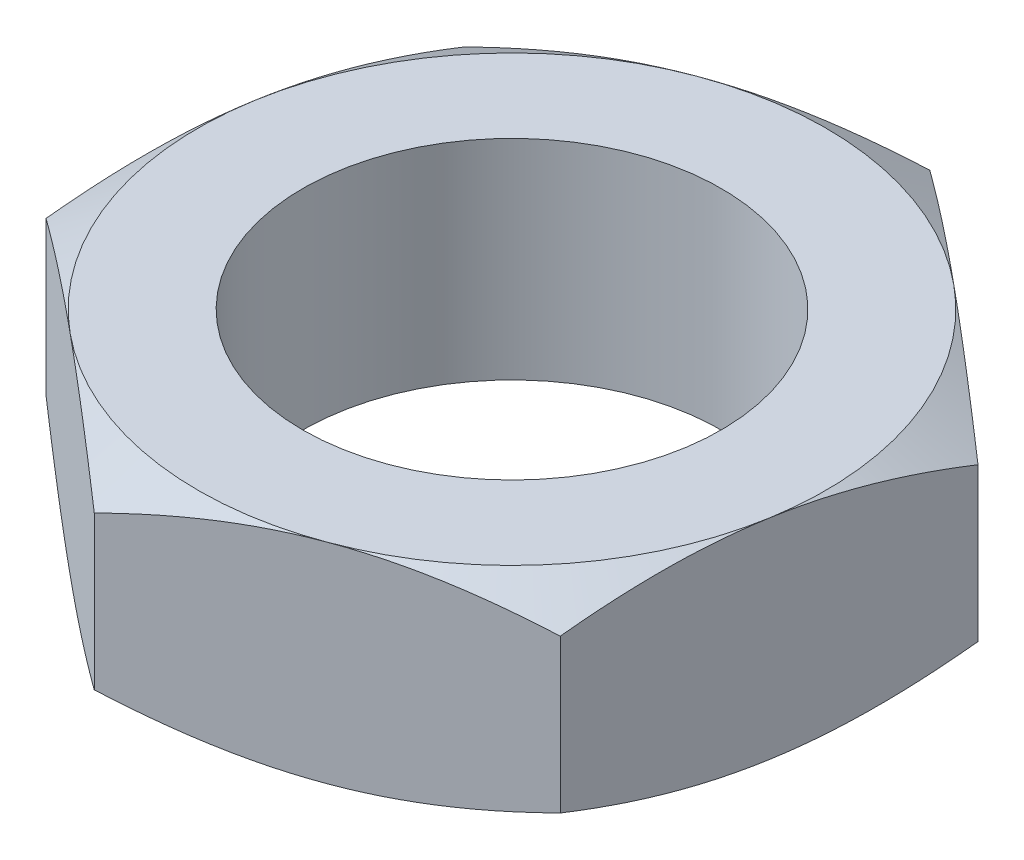
ISO-10303-21;
HEADER;
FILE_DESCRIPTION(('STEP AP214'),'2;1');
FILE_NAME('part.step','',(''),(''),'','','');
FILE_SCHEMA(('AUTOMOTIVE_DESIGN { 1 0 10303 214 1 1 1 1 }'));
ENDSEC;
DATA;
#1=APPLICATION_CONTEXT('core data for automotive mechanical design processes');
#2=APPLICATION_PROTOCOL_DEFINITION('international standard','automotive_design',2000,#1);
#3=PRODUCT_CONTEXT('',#1,'mechanical');
#4=PRODUCT('Part','Part','',(#3));
#5=PRODUCT_RELATED_PRODUCT_CATEGORY('part','',(#4));
#6=PRODUCT_DEFINITION_FORMATION('','',#4);
#7=PRODUCT_DEFINITION_CONTEXT('part definition',#1,'design');
#8=PRODUCT_DEFINITION('design','',#6,#7);
#9=PRODUCT_DEFINITION_SHAPE('','',#8);
#10=(LENGTH_UNIT() NAMED_UNIT(*) SI_UNIT(.MILLI.,.METRE.));
#11=(NAMED_UNIT(*) PLANE_ANGLE_UNIT() SI_UNIT($,.RADIAN.));
#12=(NAMED_UNIT(*) SI_UNIT($,.STERADIAN.) SOLID_ANGLE_UNIT());
#13=UNCERTAINTY_MEASURE_WITH_UNIT(LENGTH_MEASURE(1.E-05),#10,'distance_accuracy_value','');
#14=(GEOMETRIC_REPRESENTATION_CONTEXT(3) GLOBAL_UNCERTAINTY_ASSIGNED_CONTEXT((#13)) GLOBAL_UNIT_ASSIGNED_CONTEXT((#10,
#11,#12)) REPRESENTATION_CONTEXT('',''));
#15=CARTESIAN_POINT('',(0.,0.,0.));
#16=DIRECTION('',(0.,0.,1.));
#17=DIRECTION('',(1.,0.,0.));
#18=AXIS2_PLACEMENT_3D('',#15,#16,#17);
#19=CARTESIAN_POINT('',(-1.44369467023749,5.,8.53907171179209));
#20=DIRECTION('',(-0.34863406811952,0.,-0.937258921828133));
#21=DIRECTION('',(-0.937258921828133,0.,0.34863406811952));
#22=AXIS2_PLACEMENT_3D('',#19,#20,#21);
#23=PLANE('',#22);
#24=CARTESIAN_POINT('',(6.67340569203028,0.669934582085275,5.51973772123151));
#25=CARTESIAN_POINT('',(6.49498732644152,0.61499041368803,5.58610435607892));
#26=CARTESIAN_POINT('',(6.31590373120375,0.562539844764627,5.65271843772397));
#27=CARTESIAN_POINT('',(5.95628219341445,0.463312688605474,5.78648757748136));
#28=CARTESIAN_POINT('',(5.77574365902302,0.416538549046466,5.85364285574156));
#29=CARTESIAN_POINT('',(5.23123744179099,0.285648891076474,6.05618391799114));
#30=CARTESIAN_POINT('',(4.86512041892743,0.211200490063354,6.19236919627024));
#31=CARTESIAN_POINT('',(4.31723296252882,0.123901221271782,6.39616798478786));
#32=CARTESIAN_POINT('',(4.13709953241467,0.0990322370979437,6.46317257560309));
#33=CARTESIAN_POINT('',(3.77601876178583,0.0573306993877993,6.59748450910651));
#34=CARTESIAN_POINT('',(3.59507149461047,0.0404974357964017,6.66479182451452));
#35=CARTESIAN_POINT('',(3.23286270958824,0.0152963397422831,6.79952334777878));
#36=CARTESIAN_POINT('',(3.05160178328159,0.00691890019796405,6.86694733559865));
#37=CARTESIAN_POINT('',(2.68892251831363,-0.00119990207370901,7.0018538642255));
#38=CARTESIAN_POINT('',(2.50750418468866,-0.000941531608342203,7.0693364031591));
#39=CARTESIAN_POINT('',(2.01048216082673,0.0116366203444909,7.25421467541497));
#40=CARTESIAN_POINT('',(1.69504118336627,0.032750367326311,7.37154988414164));
#41=CARTESIAN_POINT('',(1.06625435166348,0.0997010500425559,7.60544097443817));
#42=CARTESIAN_POINT('',(0.752910708611471,0.145560867086196,7.72199603350715));
#43=CARTESIAN_POINT('',(0.122858541479935,0.260196634976687,7.95635779314358));
#44=CARTESIAN_POINT('',(-0.19377048564775,0.32945826489346,8.0741349230715));
#45=CARTESIAN_POINT('',(-0.822306823607496,0.486654039468555,8.30793283671146));
#46=CARTESIAN_POINT('',(-1.13422218333332,0.574551261711175,8.42395661438654));
#47=CARTESIAN_POINT('',(-1.44389467023749,0.669934582085275,8.53914610619048));
#48=B_SPLINE_CURVE_WITH_KNOTS('',3,(#24,#25,#26,#27,#28,#29,#30,#31,#32,#33,#34,#35,#36,#37,#38,
#39,#40,#41,#42,#43,#44,#45,#46,#47),.UNSPECIFIED.,.F.,.F.,(4,2,2,2,2,2,2,2,2,2,2,4),(0.,
0.594350167566524,1.18895571516085,2.38063749631713,2.96188394546358,3.54307902480116,
4.12361303374696,4.70412910684701,5.71472439101079,6.7262557214494,7.76022088252539,
8.79215629474527),.UNSPECIFIED.);
#49=CARTESIAN_POINT('',(6.67320569203028,0.669872981077802,5.5198121156299));
#50=VERTEX_POINT('',#49);
#51=CARTESIAN_POINT('',(2.6147555108964,0.,7.029441913711));
#52=VERTEX_POINT('',#51);
#53=EDGE_CURVE('E125',#50,#52,#48,.T.);
#54=ORIENTED_EDGE('',*,*,#53,.F.);
#55=DIRECTION('',(0.,-1.,0.));
#56=VECTOR('',#55,1.);
#57=CARTESIAN_POINT('',(6.67320569203028,5.,5.5198121156299));
#58=LINE('',#57,#56);
#59=CARTESIAN_POINT('',(6.67320569203028,4.3301270189222,5.5198121156299));
#60=VERTEX_POINT('',#59);
#61=EDGE_CURVE('E247',#60,#50,#58,.T.);
#62=ORIENTED_EDGE('',*,*,#61,.F.);
#63=CARTESIAN_POINT('',(-1.44389467023749,4.33006541791473,8.53914610619048));
#64=CARTESIAN_POINT('',(-1.26547630464873,4.38500958631197,8.47277947134307));
#65=CARTESIAN_POINT('',(-1.08639270941096,4.43746015523537,8.40616538969802));
#66=CARTESIAN_POINT('',(-0.726771171621659,4.53668731139453,8.27239624994063));
#67=CARTESIAN_POINT('',(-0.54623263723023,4.58346145095353,8.20524097168044));
#68=CARTESIAN_POINT('',(-0.00172641999819813,4.71435110892353,8.00269990943085));
#69=CARTESIAN_POINT('',(0.364390602865364,4.78879950993665,7.86651463115175));
#70=CARTESIAN_POINT('',(0.912278059263968,4.87609877872822,7.66271584263413));
#71=CARTESIAN_POINT('',(1.09241148937812,4.90096776290206,7.5957112518189));
#72=CARTESIAN_POINT('',(1.45349226000696,4.9426693006122,7.46139931831548));
#73=CARTESIAN_POINT('',(1.63443952718232,4.9595025642036,7.39409200290748));
#74=CARTESIAN_POINT('',(1.99664831220455,4.98470366025772,7.25936047964321));
#75=CARTESIAN_POINT('',(2.1779092385112,4.99308109980204,7.19193649182334));
#76=CARTESIAN_POINT('',(2.54058850347916,5.00119990207371,7.0570299631965));
#77=CARTESIAN_POINT('',(2.72200683710413,5.00094153160834,6.98954742426289));
#78=CARTESIAN_POINT('',(3.21902886096606,4.98836337965551,6.80466915200702));
#79=CARTESIAN_POINT('',(3.53446983842652,4.96724963267369,6.68733394328035));
#80=CARTESIAN_POINT('',(4.16325667012932,4.90029894995745,6.45344285298383));
#81=CARTESIAN_POINT('',(4.47660031318132,4.85443913291381,6.33688779391484));
#82=CARTESIAN_POINT('',(5.10665248031286,4.73980336502331,6.10252603427841));
#83=CARTESIAN_POINT('',(5.42328150744054,4.67054173510654,5.98474890435049));
#84=CARTESIAN_POINT('',(6.05181784540029,4.51334596053145,5.75095099071054));
#85=CARTESIAN_POINT('',(6.36373320512611,4.42544873828883,5.63492721303545));
#86=CARTESIAN_POINT('',(6.67340569203028,4.33006541791473,5.51973772123151));
#87=B_SPLINE_CURVE_WITH_KNOTS('',3,(#63,#64,#65,#66,#67,#68,#69,#70,#71,#72,#73,#74,#75,#76,#77,
#78,#79,#80,#81,#82,#83,#84,#85,#86),.UNSPECIFIED.,.F.,.F.,(4,2,2,2,2,2,2,2,2,2,2,4),(0.,
0.594350167566525,1.18895571516085,2.38063749631713,2.96188394546359,3.54307902480116,
4.12361303374696,4.70412910684701,5.71472439101079,6.72625572144941,7.76022088252539,
8.79215629474527),.UNSPECIFIED.);
#88=CARTESIAN_POINT('',(2.6147555108964,5.,7.029441913711));
#89=VERTEX_POINT('',#88);
#90=EDGE_CURVE('E228',#89,#60,#87,.T.);
#91=ORIENTED_EDGE('',*,*,#90,.F.);
#92=CARTESIAN_POINT('',(-1.44369467023749,4.3301270189222,8.53907171179209));
#93=VERTEX_POINT('',#92);
#94=EDGE_CURVE('E233',#93,#89,#87,.T.);
#95=ORIENTED_EDGE('',*,*,#94,.F.);
#96=DIRECTION('',(0.,-1.,0.));
#97=VECTOR('',#96,1.);
#98=CARTESIAN_POINT('',(-1.44369467023749,5.,8.53907171179209));
#99=LINE('',#98,#97);
#100=CARTESIAN_POINT('',(-1.44369467023749,0.669872981077804,8.53907171179209));
#101=VERTEX_POINT('',#100);
#102=EDGE_CURVE('E155',#93,#101,#99,.T.);
#103=ORIENTED_EDGE('',*,*,#102,.T.);
#104=EDGE_CURVE('E137',#52,#101,#48,.T.);
#105=ORIENTED_EDGE('',*,*,#104,.F.);
#106=EDGE_LOOP('',(#54,#62,#91,#95,#103,#105));
#107=FACE_BOUND('',#106,.T.);
#108=ADVANCED_FACE('F35',(#107),#23,.F.);
#109=CARTESIAN_POINT('',(6.67320569203028,5.,5.5198121156299));
#110=DIRECTION('',(-0.986007070286536,0.,-0.166703501297848));
#111=DIRECTION('',(-0.166703501297848,0.,0.986007070286536));
#112=AXIS2_PLACEMENT_3D('',#109,#110,#111);
#113=PLANE('',#112);
#114=CARTESIAN_POINT('',(8.11693417612292,0.669931536480535,-3.01945959616219));
#115=CARTESIAN_POINT('',(8.08520019987834,0.614987494088027,-2.83176152922384));
#116=CARTESIAN_POINT('',(8.05334790409476,0.562537054216301,-2.64336363354107));
#117=CARTESIAN_POINT('',(7.98938463854219,0.463310161762978,-2.26503785404365));
#118=CARTESIAN_POINT('',(7.95727356350703,0.416536156859956,-2.07510934760759));
#119=CARTESIAN_POINT('',(7.86042620741353,0.285646912260097,-1.50228287963715));
#120=CARTESIAN_POINT('',(7.79530763940616,0.211198797092288,-1.1171237920216));
#121=CARTESIAN_POINT('',(7.69785888875528,0.123899954229493,-0.54074023448197));
#122=CARTESIAN_POINT('',(7.66581986681431,0.0990311093659153,-0.351237903019766));
#123=CARTESIAN_POINT('',(7.60159705945798,0.0573298489513181,0.0286229975251619));
#124=CARTESIAN_POINT('',(7.56941328708685,0.0404967233463565,0.218981489454665));
#125=CARTESIAN_POINT('',(7.50498984963335,0.0152958983657101,0.600029063901352));
#126=CARTESIAN_POINT('',(7.47275028976229,0.00691859196391466,0.790717524121497));
#127=CARTESIAN_POINT('',(7.40824317319374,-0.00119995198440777,1.17226003837705));
#128=CARTESIAN_POINT('',(7.37597561739202,-0.000941456342233854,1.36311408711427));
#129=CARTESIAN_POINT('',(7.2875741645718,0.0116369901313172,1.88598527353643));
#130=CARTESIAN_POINT('',(7.23146920871259,0.0327507878641885,2.21783123192727));
#131=CARTESIAN_POINT('',(7.11963193933104,0.0997013333310604,2.87931906795497));
#132=CARTESIAN_POINT('',(7.06390001908873,0.145560961828871,3.20895861944455));
#133=CARTESIAN_POINT('',(6.95183769884847,0.260196141216312,3.87177757171231));
#134=CARTESIAN_POINT('',(6.89552143817182,0.329457363606809,4.20487334214886));
#135=CARTESIAN_POINT('',(6.78372872548718,0.486652168279931,4.86609763711207));
#136=CARTESIAN_POINT('',(6.72825084191222,0.574548828915974,5.19423462897829));
#137=CARTESIAN_POINT('',(6.67317187817512,0.669931536480537,5.5200121156299));
#138=B_SPLINE_CURVE_WITH_KNOTS('',3,(#114,#115,#116,#117,#118,#119,#120,#121,#122,#123,#124,
#125,#126,#127,#128,#129,#130,#131,#132,#133,#134,#135,#136,#137),.UNSPECIFIED.,.F.,.F.,(4,2,2,
2,2,2,2,2,2,2,2,4),(0.,0.594349806644115,1.18895499310351,2.380636032122,2.96188215456027,
3.54307690729336,4.12361059346092,4.70412634350593,5.71471695893529,6.72624360304106,
7.76020382983172,8.79213434275382),.UNSPECIFIED.);
#139=CARTESIAN_POINT('',(8.11690036226776,0.669872981077801,-3.01925959616219));
#140=VERTEX_POINT('',#139);
#141=CARTESIAN_POINT('',(7.39505302714902,0.,1.25027625973386));
#142=VERTEX_POINT('',#141);
#143=EDGE_CURVE('E52',#140,#142,#138,.T.);
#144=ORIENTED_EDGE('',*,*,#143,.F.);
#145=DIRECTION('',(0.,-1.,0.));
#146=VECTOR('',#145,1.);
#147=CARTESIAN_POINT('',(8.11690036226776,5.,-3.01925959616219));
#148=LINE('',#147,#146);
#149=CARTESIAN_POINT('',(8.11690036226776,4.3301270189222,-3.01925959616219));
#150=VERTEX_POINT('',#149);
#151=EDGE_CURVE('E244',#150,#140,#148,.T.);
#152=ORIENTED_EDGE('',*,*,#151,.F.);
#153=CARTESIAN_POINT('',(6.67317187817512,4.33006846351947,5.5200121156299));
#154=CARTESIAN_POINT('',(6.7049058544197,4.38501250591197,5.33231404869155));
#155=CARTESIAN_POINT('',(6.73675815020328,4.4374629457837,5.14391615300878));
#156=CARTESIAN_POINT('',(6.80072141575585,4.53668983823702,4.76559037351137));
#157=CARTESIAN_POINT('',(6.83283249079101,4.58346384314005,4.57566186707531));
#158=CARTESIAN_POINT('',(6.92967984688451,4.71435308773991,4.00283539910487));
#159=CARTESIAN_POINT('',(6.99479841489188,4.78880120290771,3.61767631148931));
#160=CARTESIAN_POINT('',(7.09224716554276,4.87610004577051,3.04129275394969));
#161=CARTESIAN_POINT('',(7.12428618748373,4.90096889063409,2.85179042248748));
#162=CARTESIAN_POINT('',(7.18850899484006,4.94267015104868,2.47192952194255));
#163=CARTESIAN_POINT('',(7.22069276721119,4.95950327665364,2.28157103001305));
#164=CARTESIAN_POINT('',(7.28511620466469,4.98470410163429,1.90052345556636));
#165=CARTESIAN_POINT('',(7.31735576453575,4.99308140803609,1.70983499534622));
#166=CARTESIAN_POINT('',(7.3818628811043,5.00119995198441,1.32829248109066));
#167=CARTESIAN_POINT('',(7.41413043690602,5.00094145634224,1.13743843235345));
#168=CARTESIAN_POINT('',(7.50253188972624,4.98836300986868,0.61456724593129));
#169=CARTESIAN_POINT('',(7.55863684558545,4.96724921213581,0.282721287540443));
#170=CARTESIAN_POINT('',(7.670474114967,4.90029866666894,-0.378766548487257));
#171=CARTESIAN_POINT('',(7.72620603520931,4.85443903817113,-0.708406099976839));
#172=CARTESIAN_POINT('',(7.83826835544957,4.73980385878369,-1.3712250522446));
#173=CARTESIAN_POINT('',(7.89458461612622,4.67054263639319,-1.70432082268115));
#174=CARTESIAN_POINT('',(8.00637732881086,4.51334783172007,-2.36554511764435));
#175=CARTESIAN_POINT('',(8.06185521238582,4.42545117108403,-2.69368210951058));
#176=CARTESIAN_POINT('',(8.11693417612292,4.33006846351947,-3.01945959616219));
#177=B_SPLINE_CURVE_WITH_KNOTS('',3,(#153,#154,#155,#156,#157,#158,#159,#160,#161,#162,#163,
#164,#165,#166,#167,#168,#169,#170,#171,#172,#173,#174,#175,#176),.UNSPECIFIED.,.F.,.F.,(4,2,2,
2,2,2,2,2,2,2,2,4),(0.,0.594349806644116,1.18895499310351,2.380636032122,2.96188215456027,
3.54307690729336,4.12361059346092,4.70412634350593,5.71471695893529,6.72624360304106,
7.76020382983172,8.79213434275382),.UNSPECIFIED.);
#178=CARTESIAN_POINT('',(7.39505302714903,5.,1.25027625973386));
#179=VERTEX_POINT('',#178);
#180=EDGE_CURVE('E215',#179,#150,#177,.T.);
#181=ORIENTED_EDGE('',*,*,#180,.F.);
#182=EDGE_CURVE('E221',#60,#179,#177,.T.);
#183=ORIENTED_EDGE('',*,*,#182,.F.);
#184=ORIENTED_EDGE('',*,*,#61,.T.);
#185=EDGE_CURVE('E131',#142,#50,#138,.T.);
#186=ORIENTED_EDGE('',*,*,#185,.F.);
#187=EDGE_LOOP('',(#144,#152,#181,#183,#184,#186));
#188=FACE_BOUND('',#187,.T.);
#189=ADVANCED_FACE('F207',(#188),#113,.F.);
#190=CARTESIAN_POINT('',(8.11690036226776,5.,-3.01925959616219));
#191=DIRECTION('',(-0.637373002167017,0.,0.770555420530285));
#192=DIRECTION('',(0.770555420530285,0.,0.637373002167017));
#193=AXIS2_PLACEMENT_3D('',#190,#191,#192);
#194=PLANE('',#193);
#195=CARTESIAN_POINT('',(1.44349467023748,0.669947909270021,-8.53923714389085));
#196=CARTESIAN_POINT('',(1.59017934429502,0.615003189494995,-8.41790537646054));
#197=CARTESIAN_POINT('',(1.73741092985964,0.562552055860879,-8.29612122543796));
#198=CARTESIAN_POINT('',(2.03306978023781,0.463323745764641,-8.05156390475479));
#199=CARTESIAN_POINT('',(2.18149753162803,0.416549016971252,-7.9287903326172));
#200=CARTESIAN_POINT('',(2.62915730228068,0.285657550155301,-7.55850385565761));
#201=CARTESIAN_POINT('',(2.93015638802546,0.211207898325488,-7.30952930325144));
#202=CARTESIAN_POINT('',(3.38059604417728,0.123906765731987,-6.93694341482957));
#203=CARTESIAN_POINT('',(3.52869074651669,0.099037171956829,-6.81444532770932));
#204=CARTESIAN_POINT('',(3.82554931567242,0.0573344208415764,-6.56889564704964));
#205=CARTESIAN_POINT('',(3.97431312219173,0.040500553441359,-6.44584410338552));
#206=CARTESIAN_POINT('',(4.27209910847214,0.0152982712082999,-6.19952729991901));
#207=CARTESIAN_POINT('',(4.4211208018718,0.00692024905105455,-6.07626244241559));
#208=CARTESIAN_POINT('',(4.71929362297594,-0.001199683607605,-5.82962566446526));
#209=CARTESIAN_POINT('',(4.86844474653956,-0.000941860898707258,-5.7062537474435));
#210=CARTESIAN_POINT('',(5.27707067658355,0.0116350022508556,-5.36825452135774));
#211=CARTESIAN_POINT('',(5.53641172314486,0.0327485271370408,-5.15373785321444));
#212=CARTESIAN_POINT('',(6.05337129392387,0.0996998104171768,-4.72612931936019));
#213=CARTESIAN_POINT('',(6.31098800006821,0.14556045250706,-4.51303895748772));
#214=CARTESIAN_POINT('',(6.82898795637013,0.260198795605913,-4.08456985783058));
#215=CARTESIAN_POINT('',(7.0893058444828,0.329462208806821,-3.86924518494726));
#216=CARTESIAN_POINT('',(7.60605953930169,0.486662227553499,-3.44180694355387));
#217=CARTESIAN_POINT('',(7.86250196394722,0.574561907317877,-3.22968790094584));
#218=CARTESIAN_POINT('',(8.11710036226776,0.669947909270021,-3.01909416406342));
#219=B_SPLINE_CURVE_WITH_KNOTS('',3,(#195,#196,#197,#198,#199,#200,#201,#202,#203,#204,#205,
#206,#207,#208,#209,#210,#211,#212,#213,#214,#215,#216,#217,#218),.UNSPECIFIED.,.F.,.F.,(4,2,2,
2,2,2,2,2,2,2,2,4),(0.,0.594351746917322,1.18895887479238,2.38064390344968,2.96189178223027,
3.54308829074832,4.12362371213127,4.70414119887973,5.71475691272487,6.72630874985524,
7.76029550264454,8.792252353473),.UNSPECIFIED.);
#220=CARTESIAN_POINT('',(1.44369467023748,0.669872981077803,-8.53907171179209));
#221=VERTEX_POINT('',#220);
#222=CARTESIAN_POINT('',(4.78029751625262,0.,-5.77916565397714));
#223=VERTEX_POINT('',#222);
#224=EDGE_CURVE('E59',#221,#223,#219,.T.);
#225=ORIENTED_EDGE('',*,*,#224,.F.);
#226=DIRECTION('',(0.,-1.,0.));
#227=VECTOR('',#226,1.);
#228=CARTESIAN_POINT('',(1.44369467023748,5.,-8.53907171179209));
#229=LINE('',#228,#227);
#230=CARTESIAN_POINT('',(1.44369467023748,4.3301270189222,-8.53907171179209));
#231=VERTEX_POINT('',#230);
#232=EDGE_CURVE('E241',#231,#221,#229,.T.);
#233=ORIENTED_EDGE('',*,*,#232,.F.);
#234=CARTESIAN_POINT('',(8.11710036226776,4.33005209072998,-3.01909416406342));
#235=CARTESIAN_POINT('',(7.97041568821022,4.38499681050501,-3.14042593149373));
#236=CARTESIAN_POINT('',(7.82318410264561,4.43744794413912,-3.26221008251631));
#237=CARTESIAN_POINT('',(7.52752525226744,4.53667625423536,-3.50676740319948));
#238=CARTESIAN_POINT('',(7.37909750087722,4.58345098302875,-3.62954097533707));
#239=CARTESIAN_POINT('',(6.93143773022457,4.7143424498447,-3.99982745229667));
#240=CARTESIAN_POINT('',(6.63043864447979,4.78879210167451,-4.24880200470283));
#241=CARTESIAN_POINT('',(6.17999898832797,4.87609323426802,-4.62138789312471));
#242=CARTESIAN_POINT('',(6.03190428598856,4.90096282804317,-4.74388598024496));
#243=CARTESIAN_POINT('',(5.73504571683282,4.94266557915843,-4.98943566090464));
#244=CARTESIAN_POINT('',(5.58628191031351,4.95949944655864,-5.11248720456875));
#245=CARTESIAN_POINT('',(5.28849592403311,4.9847017287917,-5.35880400803526));
#246=CARTESIAN_POINT('',(5.13947423063345,4.99307975094895,-5.48206886553868));
#247=CARTESIAN_POINT('',(4.8413014095293,5.00119968360761,-5.72870564348902));
#248=CARTESIAN_POINT('',(4.69215028596569,5.00094186089871,-5.85207756051077));
#249=CARTESIAN_POINT('',(4.2835243559217,4.98836499774915,-6.19007678659654));
#250=CARTESIAN_POINT('',(4.02418330936039,4.96725147286296,-6.40459345473984));
#251=CARTESIAN_POINT('',(3.50722373858137,4.90030018958282,-6.83220198859408));
#252=CARTESIAN_POINT('',(3.24960703243704,4.85443954749294,-7.04529235046655));
#253=CARTESIAN_POINT('',(2.73160707613511,4.73980120439409,-7.4737614501237));
#254=CARTESIAN_POINT('',(2.47128918802245,4.67053779119318,-7.68908612300701));
#255=CARTESIAN_POINT('',(1.95453549320355,4.5133377724465,-8.11652436440041));
#256=CARTESIAN_POINT('',(1.69809306855803,4.42543809268212,-8.32864340700843));
#257=CARTESIAN_POINT('',(1.44349467023748,4.33005209072998,-8.53923714389085));
#258=B_SPLINE_CURVE_WITH_KNOTS('',3,(#234,#235,#236,#237,#238,#239,#240,#241,#242,#243,#244,
#245,#246,#247,#248,#249,#250,#251,#252,#253,#254,#255,#256,#257),.UNSPECIFIED.,.F.,.F.,(4,2,2,
2,2,2,2,2,2,2,2,4),(0.,0.594351746917321,1.18895887479238,2.38064390344968,2.96189178223027,
3.54308829074832,4.12362371213127,4.70414119887973,5.71475691272487,6.72630874985524,
7.76029550264454,8.79225235347299),.UNSPECIFIED.);
#259=CARTESIAN_POINT('',(4.78029751625262,5.,-5.77916565397714));
#260=VERTEX_POINT('',#259);
#261=EDGE_CURVE('E223',#260,#231,#258,.T.);
#262=ORIENTED_EDGE('',*,*,#261,.F.);
#263=EDGE_CURVE('E222',#150,#260,#258,.T.);
#264=ORIENTED_EDGE('',*,*,#263,.F.);
#265=ORIENTED_EDGE('',*,*,#151,.T.);
#266=EDGE_CURVE('E201',#223,#140,#219,.T.);
#267=ORIENTED_EDGE('',*,*,#266,.F.);
#268=EDGE_LOOP('',(#225,#233,#262,#264,#265,#267));
#269=FACE_BOUND('',#268,.T.);
#270=ADVANCED_FACE('F210',(#269),#194,.F.);
#271=CARTESIAN_POINT('',(1.44369467023748,5.,-8.53907171179209));
#272=DIRECTION('',(0.34863406811952,0.,0.937258921828133));
#273=DIRECTION('',(0.937258921828133,0.,-0.34863406811952));
#274=AXIS2_PLACEMENT_3D('',#271,#272,#273);
#275=PLANE('',#274);
#276=CARTESIAN_POINT('',(-6.67340569203028,0.669934582085276,-5.51973772123151));
#277=CARTESIAN_POINT('',(-6.49498732644152,0.614990413688031,-5.58610435607892));
#278=CARTESIAN_POINT('',(-6.31590373120376,0.562539844764629,-5.65271843772398));
#279=CARTESIAN_POINT('',(-5.95628219341445,0.463312688605475,-5.78648757748136));
#280=CARTESIAN_POINT('',(-5.77574365902302,0.416538549046468,-5.85364285574156));
#281=CARTESIAN_POINT('',(-5.23123744179099,0.285648891076476,-6.05618391799115));
#282=CARTESIAN_POINT('',(-4.86512041892743,0.211200490063354,-6.19236919627024));
#283=CARTESIAN_POINT('',(-4.31723296252883,0.123901221271783,-6.39616798478786));
#284=CARTESIAN_POINT('',(-4.13709953241467,0.0990322370979451,-6.46317257560309));
#285=CARTESIAN_POINT('',(-3.77601876178583,0.0573306993878009,-6.59748450910651));
#286=CARTESIAN_POINT('',(-3.59507149461047,0.0404974357964031,-6.66479182451452));
#287=CARTESIAN_POINT('',(-3.23286270958824,0.0152963397422842,-6.79952334777878));
#288=CARTESIAN_POINT('',(-3.05160178328159,0.00691890019796537,-6.86694733559865));
#289=CARTESIAN_POINT('',(-2.68892251831363,-0.00119990207370782,-7.0018538642255));
#290=CARTESIAN_POINT('',(-2.50750418468866,-0.000941531608341314,-7.0693364031591));
#291=CARTESIAN_POINT('',(-2.01048216082673,0.0116366203444914,-7.25421467541497));
#292=CARTESIAN_POINT('',(-1.69504118336627,0.0327503673263117,-7.37154988414164));
#293=CARTESIAN_POINT('',(-1.06625435166348,0.0997010500425567,-7.60544097443817));
#294=CARTESIAN_POINT('',(-0.752910708611473,0.145560867086196,-7.72199603350715));
#295=CARTESIAN_POINT('',(-0.122858541479938,0.260196634976688,-7.95635779314358));
#296=CARTESIAN_POINT('',(0.193770485647746,0.329458264893461,-8.0741349230715));
#297=CARTESIAN_POINT('',(0.822306823607492,0.486654039468556,-8.30793283671146));
#298=CARTESIAN_POINT('',(1.13422218333331,0.574551261711175,-8.42395661438654));
#299=CARTESIAN_POINT('',(1.44389467023748,0.669934582085276,-8.53914610619048));
#300=B_SPLINE_CURVE_WITH_KNOTS('',3,(#276,#277,#278,#279,#280,#281,#282,#283,#284,#285,#286,
#287,#288,#289,#290,#291,#292,#293,#294,#295,#296,#297,#298,#299),.UNSPECIFIED.,.F.,.F.,(4,2,2,
2,2,2,2,2,2,2,2,4),(0.,0.594350167566525,1.18895571516085,2.38063749631713,2.96188394546359,
3.54307902480116,4.12361303374696,4.70412910684701,5.71472439101079,6.7262557214494,
7.76022088252539,8.79215629474526),.UNSPECIFIED.);
#301=CARTESIAN_POINT('',(-6.67320569203028,0.669872981077805,-5.5198121156299));
#302=VERTEX_POINT('',#301);
#303=CARTESIAN_POINT('',(-2.6147555108964,0.,-7.029441913711));
#304=VERTEX_POINT('',#303);
#305=EDGE_CURVE('E168',#302,#304,#300,.T.);
#306=ORIENTED_EDGE('',*,*,#305,.F.);
#307=DIRECTION('',(0.,-1.,0.));
#308=VECTOR('',#307,1.);
#309=CARTESIAN_POINT('',(-6.67320569203028,5.,-5.5198121156299));
#310=LINE('',#309,#308);
#311=CARTESIAN_POINT('',(-6.67320569203028,4.3301270189222,-5.5198121156299));
#312=VERTEX_POINT('',#311);
#313=EDGE_CURVE('E238',#312,#302,#310,.T.);
#314=ORIENTED_EDGE('',*,*,#313,.F.);
#315=CARTESIAN_POINT('',(1.44389467023748,4.33006541791473,-8.53914610619048));
#316=CARTESIAN_POINT('',(1.26547630464872,4.38500958631197,-8.47277947134307));
#317=CARTESIAN_POINT('',(1.08639270941096,4.43746015523537,-8.40616538969802));
#318=CARTESIAN_POINT('',(0.726771171621654,4.53668731139453,-8.27239624994063));
#319=CARTESIAN_POINT('',(0.546232637230225,4.58346145095354,-8.20524097168044));
#320=CARTESIAN_POINT('',(0.00172641999819276,4.71435110892353,-8.00269990943085));
#321=CARTESIAN_POINT('',(-0.364390602865369,4.78879950993665,-7.86651463115175));
#322=CARTESIAN_POINT('',(-0.912278059263973,4.87609877872822,-7.66271584263413));
#323=CARTESIAN_POINT('',(-1.09241148937812,4.90096776290206,-7.5957112518189));
#324=CARTESIAN_POINT('',(-1.45349226000697,4.9426693006122,-7.46139931831548));
#325=CARTESIAN_POINT('',(-1.63443952718233,4.9595025642036,-7.39409200290748));
#326=CARTESIAN_POINT('',(-1.99664831220456,4.98470366025772,-7.25936047964321));
#327=CARTESIAN_POINT('',(-2.17790923851121,4.99308109980204,-7.19193649182334));
#328=CARTESIAN_POINT('',(-2.54058850347917,5.00119990207371,-7.0570299631965));
#329=CARTESIAN_POINT('',(-2.72200683710414,5.00094153160834,-6.98954742426289));
#330=CARTESIAN_POINT('',(-3.21902886096607,4.98836337965551,-6.80466915200702));
#331=CARTESIAN_POINT('',(-3.53446983842653,4.96724963267369,-6.68733394328035));
#332=CARTESIAN_POINT('',(-4.16325667012932,4.90029894995744,-6.45344285298383));
#333=CARTESIAN_POINT('',(-4.47660031318133,4.85443913291381,-6.33688779391484));
#334=CARTESIAN_POINT('',(-5.10665248031286,4.73980336502331,-6.10252603427841));
#335=CARTESIAN_POINT('',(-5.42328150744054,4.67054173510654,-5.98474890435049));
#336=CARTESIAN_POINT('',(-6.05181784540029,4.51334596053145,-5.75095099071054));
#337=CARTESIAN_POINT('',(-6.36373320512611,4.42544873828883,-5.63492721303545));
#338=CARTESIAN_POINT('',(-6.67340569203028,4.33006541791473,-5.51973772123151));
#339=B_SPLINE_CURVE_WITH_KNOTS('',3,(#315,#316,#317,#318,#319,#320,#321,#322,#323,#324,#325,
#326,#327,#328,#329,#330,#331,#332,#333,#334,#335,#336,#337,#338),.UNSPECIFIED.,.F.,.F.,(4,2,2,
2,2,2,2,2,2,2,2,4),(0.,0.594350167566525,1.18895571516085,2.38063749631713,2.96188394546359,
3.54307902480116,4.12361303374696,4.70412910684701,5.71472439101079,6.7262557214494,
7.76022088252539,8.79215629474526),.UNSPECIFIED.);
#340=CARTESIAN_POINT('',(-2.6147555108964,5.,-7.029441913711));
#341=VERTEX_POINT('',#340);
#342=EDGE_CURVE('E283',#341,#312,#339,.T.);
#343=ORIENTED_EDGE('',*,*,#342,.F.);
#344=EDGE_CURVE('E451',#231,#341,#339,.T.);
#345=ORIENTED_EDGE('',*,*,#344,.F.);
#346=ORIENTED_EDGE('',*,*,#232,.T.);
#347=EDGE_CURVE('E455',#304,#221,#300,.T.);
#348=ORIENTED_EDGE('',*,*,#347,.F.);
#349=EDGE_LOOP('',(#306,#314,#343,#345,#346,#348));
#350=FACE_BOUND('',#349,.T.);
#351=ADVANCED_FACE('F298',(#350),#275,.F.);
#352=CARTESIAN_POINT('',(-6.67320569203028,5.,-5.5198121156299));
#353=DIRECTION('',(0.986007070286536,0.,0.166703501297848));
#354=DIRECTION('',(0.166703501297848,0.,-0.986007070286536));
#355=AXIS2_PLACEMENT_3D('',#352,#353,#354);
#356=PLANE('',#355);
#357=CARTESIAN_POINT('',(-8.11693417612292,0.669931536480537,3.01945959616219));
#358=CARTESIAN_POINT('',(-8.08520019987835,0.614987494088029,2.83176152922383));
#359=CARTESIAN_POINT('',(-8.05334790409477,0.562537054216303,2.64336363354107));
#360=CARTESIAN_POINT('',(-7.98938463854219,0.46331016176298,2.26503785404365));
#361=CARTESIAN_POINT('',(-7.95727356350704,0.416536156859959,2.07510934760759));
#362=CARTESIAN_POINT('',(-7.86042620741353,0.2856469122601,1.50228287963715));
#363=CARTESIAN_POINT('',(-7.79530763940617,0.211198797092291,1.1171237920216));
#364=CARTESIAN_POINT('',(-7.69785888875528,0.123899954229495,0.540740234481969));
#365=CARTESIAN_POINT('',(-7.66581986681432,0.0990311093659178,0.351237903019765));
#366=CARTESIAN_POINT('',(-7.60159705945799,0.0573298489513206,-0.0286229975251634));
#367=CARTESIAN_POINT('',(-7.56941328708686,0.040496723346359,-0.218981489454666));
#368=CARTESIAN_POINT('',(-7.50498984963335,0.0152958983657124,-0.600029063901353));
#369=CARTESIAN_POINT('',(-7.47275028976229,0.00691859196391687,-0.790717524121499));
#370=CARTESIAN_POINT('',(-7.40824317319375,-0.00119995198440546,-1.17226003837705));
#371=CARTESIAN_POINT('',(-7.37597561739202,-0.000941456342231365,-1.36311408711427));
#372=CARTESIAN_POINT('',(-7.28757416457181,0.0116369901313199,-1.88598527353643));
#373=CARTESIAN_POINT('',(-7.2314692087126,0.0327507878641912,-2.21783123192727));
#374=CARTESIAN_POINT('',(-7.11963193933104,0.0997013333310627,-2.87931906795497));
#375=CARTESIAN_POINT('',(-7.06390001908873,0.145560961828873,-3.20895861944456));
#376=CARTESIAN_POINT('',(-6.95183769884847,0.260196141216313,-3.87177757171231));
#377=CARTESIAN_POINT('',(-6.89552143817182,0.32945736360681,-4.20487334214886));
#378=CARTESIAN_POINT('',(-6.78372872548718,0.486652168279932,-4.86609763711207));
#379=CARTESIAN_POINT('',(-6.72825084191222,0.574548828915975,-5.19423462897829));
#380=CARTESIAN_POINT('',(-6.67317187817512,0.669931536480538,-5.5200121156299));
#381=B_SPLINE_CURVE_WITH_KNOTS('',3,(#357,#358,#359,#360,#361,#362,#363,#364,#365,#366,#367,
#368,#369,#370,#371,#372,#373,#374,#375,#376,#377,#378,#379,#380),.UNSPECIFIED.,.F.,.F.,(4,2,2,
2,2,2,2,2,2,2,2,4),(0.,0.594349806644116,1.18895499310351,2.380636032122,2.96188215456028,
3.54307690729336,4.12361059346092,4.70412634350593,5.71471695893529,6.72624360304106,
7.76020382983172,8.79213434275382),.UNSPECIFIED.);
#382=CARTESIAN_POINT('',(-8.11690036226777,0.669872981077805,3.01925959616219));
#383=VERTEX_POINT('',#382);
#384=CARTESIAN_POINT('',(-7.39505302714902,0.,-1.25027625973386));
#385=VERTEX_POINT('',#384);
#386=EDGE_CURVE('E156',#383,#385,#381,.T.);
#387=ORIENTED_EDGE('',*,*,#386,.F.);
#388=DIRECTION('',(0.,-1.,0.));
#389=VECTOR('',#388,1.);
#390=CARTESIAN_POINT('',(-8.11690036226777,5.,3.01925959616219));
#391=LINE('',#390,#389);
#392=CARTESIAN_POINT('',(-8.11690036226777,4.3301270189222,3.01925959616219));
#393=VERTEX_POINT('',#392);
#394=EDGE_CURVE('E235',#393,#383,#391,.T.);
#395=ORIENTED_EDGE('',*,*,#394,.F.);
#396=CARTESIAN_POINT('',(-6.67317187817512,4.33006846351946,-5.5200121156299));
#397=CARTESIAN_POINT('',(-6.7049058544197,4.38501250591197,-5.33231404869155));
#398=CARTESIAN_POINT('',(-6.73675815020328,4.4374629457837,-5.14391615300878));
#399=CARTESIAN_POINT('',(-6.80072141575586,4.53668983823702,-4.76559037351137));
#400=CARTESIAN_POINT('',(-6.83283249079101,4.58346384314004,-4.57566186707531));
#401=CARTESIAN_POINT('',(-6.92967984688451,4.7143530877399,-4.00283539910487));
#402=CARTESIAN_POINT('',(-6.99479841489188,4.78880120290771,-3.61767631148931));
#403=CARTESIAN_POINT('',(-7.09224716554277,4.87610004577051,-3.04129275394969));
#404=CARTESIAN_POINT('',(-7.12428618748373,4.90096889063408,-2.85179042248748));
#405=CARTESIAN_POINT('',(-7.18850899484006,4.94267015104868,-2.47192952194255));
#406=CARTESIAN_POINT('',(-7.22069276721119,4.95950327665364,-2.28157103001305));
#407=CARTESIAN_POINT('',(-7.28511620466469,4.98470410163429,-1.90052345556636));
#408=CARTESIAN_POINT('',(-7.31735576453576,4.99308140803609,-1.70983499534622));
#409=CARTESIAN_POINT('',(-7.3818628811043,5.00119995198441,-1.32829248109066));
#410=CARTESIAN_POINT('',(-7.41413043690603,5.00094145634223,-1.13743843235345));
#411=CARTESIAN_POINT('',(-7.50253188972624,4.98836300986868,-0.614567245931288));
#412=CARTESIAN_POINT('',(-7.55863684558545,4.96724921213581,-0.282721287540443));
#413=CARTESIAN_POINT('',(-7.67047411496701,4.90029866666894,0.378766548487256));
#414=CARTESIAN_POINT('',(-7.72620603520932,4.85443903817113,0.708406099976838));
#415=CARTESIAN_POINT('',(-7.83826835544957,4.73980385878369,1.37122505224459));
#416=CARTESIAN_POINT('',(-7.89458461612622,4.67054263639319,1.70432082268115));
#417=CARTESIAN_POINT('',(-8.00637732881086,4.51334783172007,2.36554511764435));
#418=CARTESIAN_POINT('',(-8.06185521238582,4.42545117108403,2.69368210951057));
#419=CARTESIAN_POINT('',(-8.11693417612292,4.33006846351946,3.01945959616219));
#420=B_SPLINE_CURVE_WITH_KNOTS('',3,(#396,#397,#398,#399,#400,#401,#402,#403,#404,#405,#406,
#407,#408,#409,#410,#411,#412,#413,#414,#415,#416,#417,#418,#419),.UNSPECIFIED.,.F.,.F.,(4,2,2,
2,2,2,2,2,2,2,2,4),(0.,0.594349806644116,1.18895499310351,2.380636032122,2.96188215456028,
3.54307690729336,4.12361059346092,4.70412634350593,5.71471695893529,6.72624360304106,
7.76020382983172,8.79213434275382),.UNSPECIFIED.);
#421=CARTESIAN_POINT('',(-7.39505302714903,5.,-1.25027625973386));
#422=VERTEX_POINT('',#421);
#423=EDGE_CURVE('E273',#422,#393,#420,.T.);
#424=ORIENTED_EDGE('',*,*,#423,.F.);
#425=EDGE_CURVE('E276',#312,#422,#420,.T.);
#426=ORIENTED_EDGE('',*,*,#425,.F.);
#427=ORIENTED_EDGE('',*,*,#313,.T.);
#428=EDGE_CURVE('E136',#385,#302,#381,.T.);
#429=ORIENTED_EDGE('',*,*,#428,.F.);
#430=EDGE_LOOP('',(#387,#395,#424,#426,#427,#429));
#431=FACE_BOUND('',#430,.T.);
#432=ADVANCED_FACE('F275',(#431),#356,.F.);
#433=CARTESIAN_POINT('',(-8.11690036226777,5.,3.01925959616219));
#434=DIRECTION('',(0.637373002167017,0.,-0.770555420530285));
#435=DIRECTION('',(-0.770555420530285,0.,-0.637373002167017));
#436=AXIS2_PLACEMENT_3D('',#433,#434,#435);
#437=PLANE('',#436);
#438=CARTESIAN_POINT('',(-1.44349467023749,0.669947909270022,8.53923714389085));
#439=CARTESIAN_POINT('',(-1.59017934429503,0.615003189494997,8.41790537646054));
#440=CARTESIAN_POINT('',(-1.73741092985964,0.56255205586088,8.29612122543796));
#441=CARTESIAN_POINT('',(-2.03306978023781,0.463323745764642,8.05156390475479));
#442=CARTESIAN_POINT('',(-2.18149753162803,0.416549016971254,7.9287903326172));
#443=CARTESIAN_POINT('',(-2.62915730228069,0.285657550155301,7.55850385565761));
#444=CARTESIAN_POINT('',(-2.93015638802546,0.21120789832549,7.30952930325144));
#445=CARTESIAN_POINT('',(-3.38059604417728,0.123906765731988,6.93694341482957));
#446=CARTESIAN_POINT('',(-3.52869074651669,0.0990371719568305,6.81444532770932));
#447=CARTESIAN_POINT('',(-3.82554931567243,0.0573344208415784,6.56889564704964));
#448=CARTESIAN_POINT('',(-3.97431312219174,0.0405005534413615,6.44584410338552));
#449=CARTESIAN_POINT('',(-4.27209910847214,0.0152982712083024,6.19952729991901));
#450=CARTESIAN_POINT('',(-4.4211208018718,0.00692024905105637,6.07626244241559));
#451=CARTESIAN_POINT('',(-4.71929362297595,-0.00119968360760332,5.82962566446526));
#452=CARTESIAN_POINT('',(-4.86844474653956,-0.000941860898705065,5.7062537474435));
#453=CARTESIAN_POINT('',(-5.27707067658355,0.0116350022508586,5.36825452135774));
#454=CARTESIAN_POINT('',(-5.53641172314486,0.0327485271370437,5.15373785321444));
#455=CARTESIAN_POINT('',(-6.05337129392388,0.0996998104171793,4.72612931936019));
#456=CARTESIAN_POINT('',(-6.31098800006821,0.145560452507062,4.51303895748772));
#457=CARTESIAN_POINT('',(-6.82898795637014,0.260198795605916,4.08456985783058));
#458=CARTESIAN_POINT('',(-7.0893058444828,0.329462208806824,3.86924518494727));
#459=CARTESIAN_POINT('',(-7.60605953930169,0.486662227553502,3.44180694355387));
#460=CARTESIAN_POINT('',(-7.86250196394722,0.57456190731788,3.22968790094584));
#461=CARTESIAN_POINT('',(-8.11710036226777,0.669947909270022,3.01909416406342));
#462=B_SPLINE_CURVE_WITH_KNOTS('',3,(#438,#439,#440,#441,#442,#443,#444,#445,#446,#447,#448,
#449,#450,#451,#452,#453,#454,#455,#456,#457,#458,#459,#460,#461),.UNSPECIFIED.,.F.,.F.,(4,2,2,
2,2,2,2,2,2,2,2,4),(0.,0.594351746917322,1.18895887479238,2.38064390344968,2.96189178223027,
3.54308829074832,4.12362371213127,4.70414119887973,5.71475691272487,6.72630874985524,
7.76029550264454,8.79225235347299),.UNSPECIFIED.);
#463=CARTESIAN_POINT('',(-4.78029751625263,0.,5.77916565397714));
#464=VERTEX_POINT('',#463);
#465=EDGE_CURVE('E143',#101,#464,#462,.T.);
#466=ORIENTED_EDGE('',*,*,#465,.F.);
#467=ORIENTED_EDGE('',*,*,#102,.F.);
#468=CARTESIAN_POINT('',(-8.11710036226777,4.33005209072998,3.01909416406342));
#469=CARTESIAN_POINT('',(-7.97041568821022,4.384996810505,3.14042593149373));
#470=CARTESIAN_POINT('',(-7.82318410264561,4.43744794413912,3.26221008251631));
#471=CARTESIAN_POINT('',(-7.52752525226744,4.53667625423536,3.50676740319948));
#472=CARTESIAN_POINT('',(-7.37909750087722,4.58345098302875,3.62954097533707));
#473=CARTESIAN_POINT('',(-6.93143773022457,4.7143424498447,3.99982745229667));
#474=CARTESIAN_POINT('',(-6.63043864447979,4.78879210167451,4.24880200470284));
#475=CARTESIAN_POINT('',(-6.17999898832797,4.87609323426801,4.62138789312471));
#476=CARTESIAN_POINT('',(-6.03190428598856,4.90096282804317,4.74388598024496));
#477=CARTESIAN_POINT('',(-5.73504571683283,4.94266557915842,4.98943566090464));
#478=CARTESIAN_POINT('',(-5.58628191031352,4.95949944655864,5.11248720456875));
#479=CARTESIAN_POINT('',(-5.28849592403311,4.9847017287917,5.35880400803526));
#480=CARTESIAN_POINT('',(-5.13947423063345,4.99307975094895,5.48206886553868));
#481=CARTESIAN_POINT('',(-4.84130140952931,5.0011996836076,5.72870564348902));
#482=CARTESIAN_POINT('',(-4.69215028596569,5.00094186089871,5.85207756051078));
#483=CARTESIAN_POINT('',(-4.2835243559217,4.98836499774914,6.19007678659654));
#484=CARTESIAN_POINT('',(-4.02418330936039,4.96725147286296,6.40459345473984));
#485=CARTESIAN_POINT('',(-3.50722373858138,4.90030018958282,6.83220198859408));
#486=CARTESIAN_POINT('',(-3.24960703243704,4.85443954749294,7.04529235046656));
#487=CARTESIAN_POINT('',(-2.73160707613512,4.73980120439409,7.4737614501237));
#488=CARTESIAN_POINT('',(-2.47128918802245,4.67053779119318,7.68908612300701));
#489=CARTESIAN_POINT('',(-1.95453549320356,4.5133377724465,8.11652436440041));
#490=CARTESIAN_POINT('',(-1.69809306855803,4.42543809268212,8.32864340700843));
#491=CARTESIAN_POINT('',(-1.44349467023749,4.33005209072998,8.53923714389085));
#492=B_SPLINE_CURVE_WITH_KNOTS('',3,(#468,#469,#470,#471,#472,#473,#474,#475,#476,#477,#478,
#479,#480,#481,#482,#483,#484,#485,#486,#487,#488,#489,#490,#491),.UNSPECIFIED.,.F.,.F.,(4,2,2,
2,2,2,2,2,2,2,2,4),(0.,0.594351746917322,1.18895887479238,2.38064390344968,2.96189178223027,
3.54308829074832,4.12362371213127,4.70414119887973,5.71475691272488,6.72630874985524,
7.76029550264454,8.79225235347299),.UNSPECIFIED.);
#493=CARTESIAN_POINT('',(-4.78029751625263,5.,5.77916565397714));
#494=VERTEX_POINT('',#493);
#495=EDGE_CURVE('E284',#494,#93,#492,.T.);
#496=ORIENTED_EDGE('',*,*,#495,.F.);
#497=EDGE_CURVE('E281',#393,#494,#492,.T.);
#498=ORIENTED_EDGE('',*,*,#497,.F.);
#499=ORIENTED_EDGE('',*,*,#394,.T.);
#500=EDGE_CURVE('E188',#464,#383,#462,.T.);
#501=ORIENTED_EDGE('',*,*,#500,.F.);
#502=EDGE_LOOP('',(#466,#467,#496,#498,#499,#501));
#503=FACE_BOUND('',#502,.T.);
#504=ADVANCED_FACE('F297',(#503),#437,.F.);
#505=CARTESIAN_POINT('',(0.,5.,0.));
#506=DIRECTION('',(0.,-1.,0.));
#507=DIRECTION('',(0.,0.,1.));
#508=AXIS2_PLACEMENT_3D('',#505,#506,#507);
#509=CONICAL_SURFACE('',#508,7.5,1.0471975511966);
#510=ORIENTED_EDGE('',*,*,#94,.T.);
#511=CARTESIAN_POINT('',(0.,5.,0.));
#512=DIRECTION('',(0.,1.,0.));
#513=DIRECTION('',(0.,0.,1.));
#514=AXIS2_PLACEMENT_3D('',#511,#512,#513);
#515=CIRCLE('',#514,7.5);
#516=EDGE_CURVE('E249',#494,#89,#515,.T.);
#517=ORIENTED_EDGE('',*,*,#516,.F.);
#518=ORIENTED_EDGE('',*,*,#495,.T.);
#519=EDGE_LOOP('',(#510,#517,#518));
#520=FACE_BOUND('',#519,.T.);
#521=ADVANCED_FACE('F183',(#520),#509,.T.);
#522=ORIENTED_EDGE('',*,*,#423,.T.);
#523=ORIENTED_EDGE('',*,*,#497,.T.);
#524=EDGE_CURVE('E251',#422,#494,#515,.T.);
#525=ORIENTED_EDGE('',*,*,#524,.F.);
#526=EDGE_LOOP('',(#522,#523,#525));
#527=FACE_BOUND('',#526,.T.);
#528=ADVANCED_FACE('F428',(#527),#509,.T.);
#529=ORIENTED_EDGE('',*,*,#342,.T.);
#530=ORIENTED_EDGE('',*,*,#425,.T.);
#531=EDGE_CURVE('E256',#341,#422,#515,.T.);
#532=ORIENTED_EDGE('',*,*,#531,.F.);
#533=EDGE_LOOP('',(#529,#530,#532));
#534=FACE_BOUND('',#533,.T.);
#535=ADVANCED_FACE('F430',(#534),#509,.T.);
#536=ORIENTED_EDGE('',*,*,#261,.T.);
#537=ORIENTED_EDGE('',*,*,#344,.T.);
#538=EDGE_CURVE('E258',#260,#341,#515,.T.);
#539=ORIENTED_EDGE('',*,*,#538,.F.);
#540=EDGE_LOOP('',(#536,#537,#539));
#541=FACE_BOUND('',#540,.T.);
#542=ADVANCED_FACE('F434',(#541),#509,.T.);
#543=ORIENTED_EDGE('',*,*,#180,.T.);
#544=ORIENTED_EDGE('',*,*,#263,.T.);
#545=EDGE_CURVE('E148',#179,#260,#515,.T.);
#546=ORIENTED_EDGE('',*,*,#545,.F.);
#547=EDGE_LOOP('',(#543,#544,#546));
#548=FACE_BOUND('',#547,.T.);
#549=ADVANCED_FACE('F439',(#548),#509,.T.);
#550=ORIENTED_EDGE('',*,*,#90,.T.);
#551=ORIENTED_EDGE('',*,*,#182,.T.);
#552=CARTESIAN_POINT('',(0.,5.,0.));
#553=DIRECTION('',(0.,1.,0.));
#554=DIRECTION('',(0.,0.,1.));
#555=AXIS2_PLACEMENT_3D('',#552,#553,#554);
#556=CIRCLE('',#555,7.5);
#557=EDGE_CURVE('E445',#89,#179,#556,.T.);
#558=ORIENTED_EDGE('',*,*,#557,.F.);
#559=EDGE_LOOP('',(#550,#551,#558));
#560=FACE_BOUND('',#559,.T.);
#561=ADVANCED_FACE('F397',(#560),#509,.T.);
#562=CARTESIAN_POINT('',(0.,5.,0.));
#563=DIRECTION('',(0.,1.,0.));
#564=DIRECTION('',(0.,0.,1.));
#565=AXIS2_PLACEMENT_3D('',#562,#563,#564);
#566=PLANE('',#565);
#567=CARTESIAN_POINT('',(0.,5.,0.));
#568=DIRECTION('',(0.,1.,0.));
#569=DIRECTION('',(0.,0.,1.));
#570=AXIS2_PLACEMENT_3D('',#567,#568,#569);
#571=CIRCLE('',#570,5.);
#572=CARTESIAN_POINT('',(0.,5.,5.));
#573=VERTEX_POINT('',#572);
#574=EDGE_CURVE('E420',#573,#573,#571,.T.);
#575=ORIENTED_EDGE('',*,*,#574,.F.);
#576=EDGE_LOOP('',(#575));
#577=FACE_BOUND('',#576,.T.);
#578=ORIENTED_EDGE('',*,*,#516,.T.);
#579=ORIENTED_EDGE('',*,*,#557,.T.);
#580=ORIENTED_EDGE('',*,*,#545,.T.);
#581=ORIENTED_EDGE('',*,*,#538,.T.);
#582=ORIENTED_EDGE('',*,*,#531,.T.);
#583=ORIENTED_EDGE('',*,*,#524,.T.);
#584=EDGE_LOOP('',(#578,#579,#580,#581,#582,#583));
#585=FACE_BOUND('',#584,.T.);
#586=ADVANCED_FACE('F267',(#577,#585),#566,.T.);
#587=CARTESIAN_POINT('',(0.,0.,0.));
#588=DIRECTION('',(0.,1.,0.));
#589=DIRECTION('',(0.,0.,-1.));
#590=AXIS2_PLACEMENT_3D('',#587,#588,#589);
#591=CONICAL_SURFACE('',#590,7.5,1.0471975511966);
#592=ORIENTED_EDGE('',*,*,#104,.T.);
#593=ORIENTED_EDGE('',*,*,#465,.T.);
#594=CARTESIAN_POINT('',(0.,0.,0.));
#595=DIRECTION('',(0.,1.,0.));
#596=DIRECTION('',(0.,0.,1.));
#597=AXIS2_PLACEMENT_3D('',#594,#595,#596);
#598=CIRCLE('',#597,7.5);
#599=EDGE_CURVE('E45',#464,#52,#598,.T.);
#600=ORIENTED_EDGE('',*,*,#599,.T.);
#601=EDGE_LOOP('',(#592,#593,#600));
#602=FACE_BOUND('',#601,.T.);
#603=ADVANCED_FACE('F141',(#602),#591,.T.);
#604=ORIENTED_EDGE('',*,*,#386,.T.);
#605=EDGE_CURVE('E147',#385,#464,#598,.T.);
#606=ORIENTED_EDGE('',*,*,#605,.T.);
#607=ORIENTED_EDGE('',*,*,#500,.T.);
#608=EDGE_LOOP('',(#604,#606,#607));
#609=FACE_BOUND('',#608,.T.);
#610=ADVANCED_FACE('F181',(#609),#591,.T.);
#611=ORIENTED_EDGE('',*,*,#305,.T.);
#612=EDGE_CURVE('E457',#304,#385,#598,.T.);
#613=ORIENTED_EDGE('',*,*,#612,.T.);
#614=ORIENTED_EDGE('',*,*,#428,.T.);
#615=EDGE_LOOP('',(#611,#613,#614));
#616=FACE_BOUND('',#615,.T.);
#617=ADVANCED_FACE('F180',(#616),#591,.T.);
#618=ORIENTED_EDGE('',*,*,#224,.T.);
#619=EDGE_CURVE('E44',#223,#304,#598,.T.);
#620=ORIENTED_EDGE('',*,*,#619,.T.);
#621=ORIENTED_EDGE('',*,*,#347,.T.);
#622=EDGE_LOOP('',(#618,#620,#621));
#623=FACE_BOUND('',#622,.T.);
#624=ADVANCED_FACE('F174',(#623),#591,.T.);
#625=ORIENTED_EDGE('',*,*,#266,.T.);
#626=ORIENTED_EDGE('',*,*,#143,.T.);
#627=CARTESIAN_POINT('',(0.,0.,0.));
#628=DIRECTION('',(0.,-1.,0.));
#629=DIRECTION('',(0.,0.,-1.));
#630=AXIS2_PLACEMENT_3D('',#627,#628,#629);
#631=CIRCLE('',#630,7.5);
#632=EDGE_CURVE('E151',#223,#142,#631,.T.);
#633=ORIENTED_EDGE('',*,*,#632,.F.);
#634=EDGE_LOOP('',(#625,#626,#633));
#635=FACE_BOUND('',#634,.T.);
#636=ADVANCED_FACE('F179',(#635),#591,.T.);
#637=ORIENTED_EDGE('',*,*,#185,.T.);
#638=ORIENTED_EDGE('',*,*,#53,.T.);
#639=EDGE_CURVE('E12',#52,#142,#598,.T.);
#640=ORIENTED_EDGE('',*,*,#639,.T.);
#641=EDGE_LOOP('',(#637,#638,#640));
#642=FACE_BOUND('',#641,.T.);
#643=ADVANCED_FACE('F127',(#642),#591,.T.);
#644=CARTESIAN_POINT('',(0.,0.,0.));
#645=DIRECTION('',(0.,1.,0.));
#646=DIRECTION('',(0.,0.,1.));
#647=AXIS2_PLACEMENT_3D('',#644,#645,#646);
#648=PLANE('',#647);
#649=CARTESIAN_POINT('',(0.,0.,0.));
#650=DIRECTION('',(0.,1.,0.));
#651=DIRECTION('',(0.,0.,1.));
#652=AXIS2_PLACEMENT_3D('',#649,#650,#651);
#653=CIRCLE('',#652,5.);
#654=CARTESIAN_POINT('',(0.,0.,5.));
#655=VERTEX_POINT('',#654);
#656=EDGE_CURVE('E39',#655,#655,#653,.T.);
#657=ORIENTED_EDGE('',*,*,#656,.T.);
#658=EDGE_LOOP('',(#657));
#659=FACE_BOUND('',#658,.T.);
#660=ORIENTED_EDGE('',*,*,#639,.F.);
#661=ORIENTED_EDGE('',*,*,#599,.F.);
#662=ORIENTED_EDGE('',*,*,#605,.F.);
#663=ORIENTED_EDGE('',*,*,#612,.F.);
#664=ORIENTED_EDGE('',*,*,#619,.F.);
#665=ORIENTED_EDGE('',*,*,#632,.T.);
#666=EDGE_LOOP('',(#660,#661,#662,#663,#664,#665));
#667=FACE_BOUND('',#666,.T.);
#668=ADVANCED_FACE('F149',(#659,#667),#648,.F.);
#669=CARTESIAN_POINT('',(0.,-4.,0.));
#670=DIRECTION('',(0.,1.,0.));
#671=DIRECTION('',(0.,0.,1.));
#672=AXIS2_PLACEMENT_3D('',#669,#670,#671);
#673=CYLINDRICAL_SURFACE('',#672,5.);
#674=ORIENTED_EDGE('',*,*,#574,.T.);
#675=EDGE_LOOP('',(#674));
#676=FACE_BOUND('',#675,.T.);
#677=ORIENTED_EDGE('',*,*,#656,.F.);
#678=EDGE_LOOP('',(#677));
#679=FACE_BOUND('',#678,.T.);
#680=ADVANCED_FACE('F182',(#676,#679),#673,.F.);
#681=CLOSED_SHELL('',(#108,#189,#270,#351,#432,#504,#521,#528,#535,#542,#549,#561,#586,#603,
#610,#617,#624,#636,#643,#668,#680));
#682=MANIFOLD_SOLID_BREP('B2',#681);
#683=ADVANCED_BREP_SHAPE_REPRESENTATION('',(#18,#682),#14);
#684=SHAPE_DEFINITION_REPRESENTATION(#9,#683);
ENDSEC;
END-ISO-10303-21;
